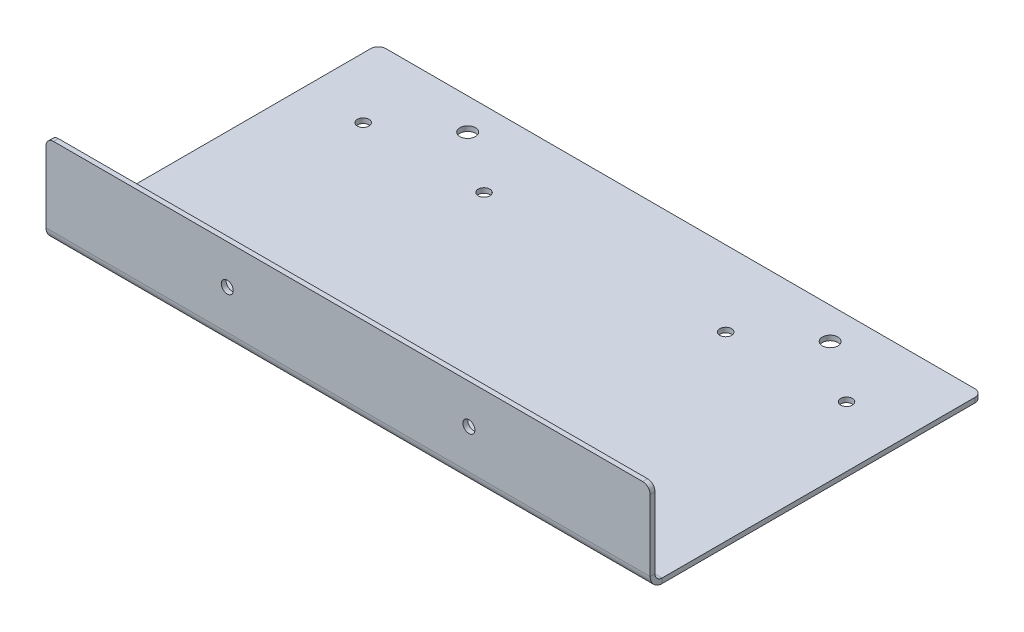
ISO-10303-21;
HEADER;
FILE_DESCRIPTION(('STEP AP214'),'2;1');
FILE_NAME('part.step','',(''),(''),'','','');
FILE_SCHEMA(('AUTOMOTIVE_DESIGN { 1 0 10303 214 1 1 1 1 }'));
ENDSEC;
DATA;
#1=APPLICATION_CONTEXT('core data for automotive mechanical design processes');
#2=APPLICATION_PROTOCOL_DEFINITION('international standard','automotive_design',2000,#1);
#3=PRODUCT_CONTEXT('',#1,'mechanical');
#4=PRODUCT('Part','Part','',(#3));
#5=PRODUCT_RELATED_PRODUCT_CATEGORY('part','',(#4));
#6=PRODUCT_DEFINITION_FORMATION('','',#4);
#7=PRODUCT_DEFINITION_CONTEXT('part definition',#1,'design');
#8=PRODUCT_DEFINITION('design','',#6,#7);
#9=PRODUCT_DEFINITION_SHAPE('','',#8);
#10=(LENGTH_UNIT() NAMED_UNIT(*) SI_UNIT(.MILLI.,.METRE.));
#11=(NAMED_UNIT(*) PLANE_ANGLE_UNIT() SI_UNIT($,.RADIAN.));
#12=(NAMED_UNIT(*) SI_UNIT($,.STERADIAN.) SOLID_ANGLE_UNIT());
#13=UNCERTAINTY_MEASURE_WITH_UNIT(LENGTH_MEASURE(1.E-05),#10,'distance_accuracy_value','');
#14=(GEOMETRIC_REPRESENTATION_CONTEXT(3) GLOBAL_UNCERTAINTY_ASSIGNED_CONTEXT((#13)) GLOBAL_UNIT_ASSIGNED_CONTEXT((#10,
#11,#12)) REPRESENTATION_CONTEXT('',''));
#15=CARTESIAN_POINT('',(0.,0.,0.));
#16=DIRECTION('',(0.,0.,1.));
#17=DIRECTION('',(1.,0.,0.));
#18=AXIS2_PLACEMENT_3D('',#15,#16,#17);
#19=CARTESIAN_POINT('',(254.,-2.052574,0.));
#20=DIRECTION('',(1.,0.,0.));
#21=DIRECTION('',(0.,0.,-1.));
#22=AXIS2_PLACEMENT_3D('',#19,#20,#21);
#23=PLANE('',#22);
#24=DIRECTION('',(0.,0.,-1.));
#25=VECTOR('',#24,1.);
#26=CARTESIAN_POINT('',(254.,-2.052574,0.));
#27=LINE('',#26,#25);
#28=CARTESIAN_POINT('',(254.,-2.05257400000001,-5.052574));
#29=VERTEX_POINT('',#28);
#30=CARTESIAN_POINT('',(254.,-2.052574,-136.525));
#31=VERTEX_POINT('',#30);
#32=EDGE_CURVE('E221',#29,#31,#27,.T.);
#33=ORIENTED_EDGE('',*,*,#32,.T.);
#34=DIRECTION('',(0.,1.,0.));
#35=VECTOR('',#34,1.);
#36=CARTESIAN_POINT('',(254.,-2.052574,-136.525));
#37=LINE('',#36,#35);
#38=CARTESIAN_POINT('',(254.,0.,-136.525));
#39=VERTEX_POINT('',#38);
#40=EDGE_CURVE('E247',#31,#39,#37,.T.);
#41=ORIENTED_EDGE('',*,*,#40,.T.);
#42=DIRECTION('',(0.,0.,-1.));
#43=VECTOR('',#42,1.);
#44=CARTESIAN_POINT('',(254.,0.,0.));
#45=LINE('',#44,#43);
#46=CARTESIAN_POINT('',(254.,0.,-5.052574));
#47=VERTEX_POINT('',#46);
#48=EDGE_CURVE('E229',#47,#39,#45,.T.);
#49=ORIENTED_EDGE('',*,*,#48,.F.);
#50=DIRECTION('',(0.,-1.,0.));
#51=VECTOR('',#50,1.);
#52=CARTESIAN_POINT('',(254.,0.,-5.052574));
#53=LINE('',#52,#51);
#54=EDGE_CURVE('E206',#47,#29,#53,.T.);
#55=ORIENTED_EDGE('',*,*,#54,.T.);
#56=EDGE_LOOP('',(#33,#41,#49,#55));
#57=FACE_BOUND('',#56,.T.);
#58=ADVANCED_FACE('F59',(#57),#23,.T.);
#59=CARTESIAN_POINT('',(0.,-2.052574,0.));
#60=DIRECTION('',(0.,-1.,0.));
#61=DIRECTION('',(0.,0.,-1.));
#62=AXIS2_PLACEMENT_3D('',#59,#60,#61);
#63=PLANE('',#62);
#64=CARTESIAN_POINT('',(203.2,-2.05257400000001,-126.48184));
#65=DIRECTION('',(0.,1.,0.));
#66=DIRECTION('',(0.,0.,1.));
#67=AXIS2_PLACEMENT_3D('',#64,#65,#66);
#68=CIRCLE('',#67,3.26389999999999);
#69=CARTESIAN_POINT('',(203.2,-2.05257400000001,-123.21794));
#70=VERTEX_POINT('',#69);
#71=EDGE_CURVE('E601',#70,#70,#68,.T.);
#72=ORIENTED_EDGE('',*,*,#71,.T.);
#73=EDGE_LOOP('',(#72));
#74=FACE_BOUND('',#73,.T.);
#75=CARTESIAN_POINT('',(50.8,-2.05257400000001,-126.48184));
#76=DIRECTION('',(0.,1.,0.));
#77=DIRECTION('',(0.,0.,1.));
#78=AXIS2_PLACEMENT_3D('',#75,#76,#77);
#79=CIRCLE('',#78,3.2639);
#80=CARTESIAN_POINT('',(50.8,-2.05257400000001,-123.21794));
#81=VERTEX_POINT('',#80);
#82=EDGE_CURVE('E595',#81,#81,#79,.T.);
#83=ORIENTED_EDGE('',*,*,#82,.T.);
#84=EDGE_LOOP('',(#83));
#85=FACE_BOUND('',#84,.T.);
#86=CARTESIAN_POINT('',(25.4,-2.05257400000001,-107.95));
#87=DIRECTION('',(0.,1.,0.));
#88=DIRECTION('',(0.,0.,1.));
#89=AXIS2_PLACEMENT_3D('',#86,#87,#88);
#90=CIRCLE('',#89,2.45745);
#91=CARTESIAN_POINT('',(25.4,-2.05257400000001,-105.49255));
#92=VERTEX_POINT('',#91);
#93=EDGE_CURVE('E589',#92,#92,#90,.T.);
#94=ORIENTED_EDGE('',*,*,#93,.T.);
#95=EDGE_LOOP('',(#94));
#96=FACE_BOUND('',#95,.T.);
#97=CARTESIAN_POINT('',(76.2,-2.05257400000001,-107.95));
#98=DIRECTION('',(0.,1.,0.));
#99=DIRECTION('',(0.,0.,1.));
#100=AXIS2_PLACEMENT_3D('',#97,#98,#99);
#101=CIRCLE('',#100,2.45745);
#102=CARTESIAN_POINT('',(76.2,-2.05257400000001,-105.49255));
#103=VERTEX_POINT('',#102);
#104=EDGE_CURVE('E583',#103,#103,#101,.T.);
#105=ORIENTED_EDGE('',*,*,#104,.T.);
#106=EDGE_LOOP('',(#105));
#107=FACE_BOUND('',#106,.T.);
#108=CARTESIAN_POINT('',(177.8,-2.05257400000001,-107.95));
#109=DIRECTION('',(0.,1.,0.));
#110=DIRECTION('',(0.,0.,1.));
#111=AXIS2_PLACEMENT_3D('',#108,#109,#110);
#112=CIRCLE('',#111,2.45745);
#113=CARTESIAN_POINT('',(177.8,-2.05257400000001,-105.49255));
#114=VERTEX_POINT('',#113);
#115=EDGE_CURVE('E577',#114,#114,#112,.T.);
#116=ORIENTED_EDGE('',*,*,#115,.T.);
#117=EDGE_LOOP('',(#116));
#118=FACE_BOUND('',#117,.T.);
#119=CARTESIAN_POINT('',(228.6,-2.05257400000001,-107.95));
#120=DIRECTION('',(0.,1.,0.));
#121=DIRECTION('',(0.,0.,1.));
#122=AXIS2_PLACEMENT_3D('',#119,#120,#121);
#123=CIRCLE('',#122,2.45745);
#124=CARTESIAN_POINT('',(228.6,-2.05257400000001,-105.49255));
#125=VERTEX_POINT('',#124);
#126=EDGE_CURVE('E571',#125,#125,#123,.T.);
#127=ORIENTED_EDGE('',*,*,#126,.T.);
#128=EDGE_LOOP('',(#127));
#129=FACE_BOUND('',#128,.T.);
#130=DIRECTION('',(-1.,0.,0.));
#131=VECTOR('',#130,1.);
#132=CARTESIAN_POINT('',(0.,-2.052574,-139.7));
#133=LINE('',#132,#131);
#134=CARTESIAN_POINT('',(250.825,-2.052574,-139.7));
#135=VERTEX_POINT('',#134);
#136=CARTESIAN_POINT('',(3.175,-2.052574,-139.7));
#137=VERTEX_POINT('',#136);
#138=EDGE_CURVE('E225',#135,#137,#133,.T.);
#139=ORIENTED_EDGE('',*,*,#138,.F.);
#140=CARTESIAN_POINT('',(250.825,-2.052574,-136.525));
#141=DIRECTION('',(0.,-1.,0.));
#142=DIRECTION('',(0.,0.,-1.));
#143=AXIS2_PLACEMENT_3D('',#140,#141,#142);
#144=CIRCLE('',#143,3.175);
#145=EDGE_CURVE('E260',#135,#31,#144,.T.);
#146=ORIENTED_EDGE('',*,*,#145,.T.);
#147=ORIENTED_EDGE('',*,*,#32,.F.);
#148=DIRECTION('',(1.,0.,0.));
#149=VECTOR('',#148,1.);
#150=CARTESIAN_POINT('',(254.,-2.05257400000001,-5.052574));
#151=LINE('',#150,#149);
#152=CARTESIAN_POINT('',(0.,-2.052574,-5.052574));
#153=VERTEX_POINT('',#152);
#154=EDGE_CURVE('E157',#29,#153,#151,.F.);
#155=ORIENTED_EDGE('',*,*,#154,.T.);
#156=DIRECTION('',(0.,0.,1.));
#157=VECTOR('',#156,1.);
#158=CARTESIAN_POINT('',(0.,-2.052574,0.));
#159=LINE('',#158,#157);
#160=CARTESIAN_POINT('',(0.,-2.052574,-136.525));
#161=VERTEX_POINT('',#160);
#162=EDGE_CURVE('E219',#161,#153,#159,.T.);
#163=ORIENTED_EDGE('',*,*,#162,.F.);
#164=CARTESIAN_POINT('',(3.175,-2.052574,-136.525));
#165=DIRECTION('',(0.,-1.,0.));
#166=DIRECTION('',(0.,0.,-1.));
#167=AXIS2_PLACEMENT_3D('',#164,#165,#166);
#168=CIRCLE('',#167,3.175);
#169=EDGE_CURVE('E80',#161,#137,#168,.T.);
#170=ORIENTED_EDGE('',*,*,#169,.T.);
#171=EDGE_LOOP('',(#139,#146,#147,#155,#163,#170));
#172=FACE_BOUND('',#171,.T.);
#173=ADVANCED_FACE('F263',(#74,#85,#96,#107,#118,#129,#172),#63,.T.);
#174=CARTESIAN_POINT('',(0.,0.,0.));
#175=DIRECTION('',(0.,-1.,0.));
#176=DIRECTION('',(0.,0.,-1.));
#177=AXIS2_PLACEMENT_3D('',#174,#175,#176);
#178=PLANE('',#177);
#179=CARTESIAN_POINT('',(203.2,0.,-126.48184));
#180=DIRECTION('',(0.,1.,0.));
#181=DIRECTION('',(0.,0.,1.));
#182=AXIS2_PLACEMENT_3D('',#179,#180,#181);
#183=CIRCLE('',#182,3.26389999999999);
#184=CARTESIAN_POINT('',(203.2,0.,-123.21794));
#185=VERTEX_POINT('',#184);
#186=EDGE_CURVE('E604',#185,#185,#183,.T.);
#187=ORIENTED_EDGE('',*,*,#186,.F.);
#188=EDGE_LOOP('',(#187));
#189=FACE_BOUND('',#188,.T.);
#190=CARTESIAN_POINT('',(50.8,0.,-126.48184));
#191=DIRECTION('',(0.,1.,0.));
#192=DIRECTION('',(0.,0.,1.));
#193=AXIS2_PLACEMENT_3D('',#190,#191,#192);
#194=CIRCLE('',#193,3.26389999999999);
#195=CARTESIAN_POINT('',(50.8,0.,-123.21794));
#196=VERTEX_POINT('',#195);
#197=EDGE_CURVE('E598',#196,#196,#194,.T.);
#198=ORIENTED_EDGE('',*,*,#197,.F.);
#199=EDGE_LOOP('',(#198));
#200=FACE_BOUND('',#199,.T.);
#201=CARTESIAN_POINT('',(25.4,0.,-107.95));
#202=DIRECTION('',(0.,1.,0.));
#203=DIRECTION('',(0.,0.,1.));
#204=AXIS2_PLACEMENT_3D('',#201,#202,#203);
#205=CIRCLE('',#204,2.45745);
#206=CARTESIAN_POINT('',(25.4,0.,-105.49255));
#207=VERTEX_POINT('',#206);
#208=EDGE_CURVE('E592',#207,#207,#205,.T.);
#209=ORIENTED_EDGE('',*,*,#208,.F.);
#210=EDGE_LOOP('',(#209));
#211=FACE_BOUND('',#210,.T.);
#212=CARTESIAN_POINT('',(76.2,0.,-107.95));
#213=DIRECTION('',(0.,1.,0.));
#214=DIRECTION('',(0.,0.,1.));
#215=AXIS2_PLACEMENT_3D('',#212,#213,#214);
#216=CIRCLE('',#215,2.45745);
#217=CARTESIAN_POINT('',(76.2,0.,-105.49255));
#218=VERTEX_POINT('',#217);
#219=EDGE_CURVE('E586',#218,#218,#216,.T.);
#220=ORIENTED_EDGE('',*,*,#219,.F.);
#221=EDGE_LOOP('',(#220));
#222=FACE_BOUND('',#221,.T.);
#223=CARTESIAN_POINT('',(177.8,0.,-107.95));
#224=DIRECTION('',(0.,1.,0.));
#225=DIRECTION('',(0.,0.,1.));
#226=AXIS2_PLACEMENT_3D('',#223,#224,#225);
#227=CIRCLE('',#226,2.45745);
#228=CARTESIAN_POINT('',(177.8,0.,-105.49255));
#229=VERTEX_POINT('',#228);
#230=EDGE_CURVE('E580',#229,#229,#227,.T.);
#231=ORIENTED_EDGE('',*,*,#230,.F.);
#232=EDGE_LOOP('',(#231));
#233=FACE_BOUND('',#232,.T.);
#234=CARTESIAN_POINT('',(228.6,0.,-107.95));
#235=DIRECTION('',(0.,1.,0.));
#236=DIRECTION('',(0.,0.,1.));
#237=AXIS2_PLACEMENT_3D('',#234,#235,#236);
#238=CIRCLE('',#237,2.45745);
#239=CARTESIAN_POINT('',(228.6,0.,-105.49255));
#240=VERTEX_POINT('',#239);
#241=EDGE_CURVE('E574',#240,#240,#238,.T.);
#242=ORIENTED_EDGE('',*,*,#241,.F.);
#243=EDGE_LOOP('',(#242));
#244=FACE_BOUND('',#243,.T.);
#245=ORIENTED_EDGE('',*,*,#48,.T.);
#246=CARTESIAN_POINT('',(250.825,0.,-136.525));
#247=DIRECTION('',(0.,-1.,0.));
#248=DIRECTION('',(0.,0.,-1.));
#249=AXIS2_PLACEMENT_3D('',#246,#247,#248);
#250=CIRCLE('',#249,3.175);
#251=CARTESIAN_POINT('',(250.825,0.,-139.7));
#252=VERTEX_POINT('',#251);
#253=EDGE_CURVE('E252',#39,#252,#250,.F.);
#254=ORIENTED_EDGE('',*,*,#253,.T.);
#255=DIRECTION('',(-1.,0.,0.));
#256=VECTOR('',#255,1.);
#257=CARTESIAN_POINT('',(0.,0.,-139.7));
#258=LINE('',#257,#256);
#259=CARTESIAN_POINT('',(3.175,0.,-139.7));
#260=VERTEX_POINT('',#259);
#261=EDGE_CURVE('E222',#252,#260,#258,.T.);
#262=ORIENTED_EDGE('',*,*,#261,.T.);
#263=CARTESIAN_POINT('',(3.175,0.,-136.525));
#264=DIRECTION('',(0.,-1.,0.));
#265=DIRECTION('',(0.,0.,-1.));
#266=AXIS2_PLACEMENT_3D('',#263,#264,#265);
#267=CIRCLE('',#266,3.175);
#268=CARTESIAN_POINT('',(0.,0.,-136.525));
#269=VERTEX_POINT('',#268);
#270=EDGE_CURVE('E250',#260,#269,#267,.F.);
#271=ORIENTED_EDGE('',*,*,#270,.T.);
#272=DIRECTION('',(0.,0.,1.));
#273=VECTOR('',#272,1.);
#274=CARTESIAN_POINT('',(0.,0.,0.));
#275=LINE('',#274,#273);
#276=CARTESIAN_POINT('',(0.,0.,-5.052574));
#277=VERTEX_POINT('',#276);
#278=EDGE_CURVE('E217',#269,#277,#275,.T.);
#279=ORIENTED_EDGE('',*,*,#278,.T.);
#280=DIRECTION('',(1.,0.,0.));
#281=VECTOR('',#280,1.);
#282=CARTESIAN_POINT('',(254.,0.,-5.052574));
#283=LINE('',#282,#281);
#284=EDGE_CURVE('E210',#47,#277,#283,.F.);
#285=ORIENTED_EDGE('',*,*,#284,.F.);
#286=EDGE_LOOP('',(#245,#254,#262,#271,#279,#285));
#287=FACE_BOUND('',#286,.T.);
#288=ADVANCED_FACE('F272',(#189,#200,#211,#222,#233,#244,#287),#178,.F.);
#289=CARTESIAN_POINT('',(0.,-2.052574,0.));
#290=DIRECTION('',(-1.,0.,0.));
#291=DIRECTION('',(0.,0.,1.));
#292=AXIS2_PLACEMENT_3D('',#289,#290,#291);
#293=PLANE('',#292);
#294=ORIENTED_EDGE('',*,*,#278,.F.);
#295=DIRECTION('',(0.,1.,0.));
#296=VECTOR('',#295,1.);
#297=CARTESIAN_POINT('',(0.,-2.052574,-136.525));
#298=LINE('',#297,#296);
#299=EDGE_CURVE('E67',#269,#161,#298,.F.);
#300=ORIENTED_EDGE('',*,*,#299,.T.);
#301=ORIENTED_EDGE('',*,*,#162,.T.);
#302=DIRECTION('',(0.,-1.,0.));
#303=VECTOR('',#302,1.);
#304=CARTESIAN_POINT('',(0.,0.,-5.052574));
#305=LINE('',#304,#303);
#306=EDGE_CURVE('E214',#277,#153,#305,.T.);
#307=ORIENTED_EDGE('',*,*,#306,.F.);
#308=EDGE_LOOP('',(#294,#300,#301,#307));
#309=FACE_BOUND('',#308,.T.);
#310=ADVANCED_FACE('F280',(#309),#293,.T.);
#311=CARTESIAN_POINT('',(0.,-2.052574,-139.7));
#312=DIRECTION('',(0.,0.,-1.));
#313=DIRECTION('',(-1.,0.,0.));
#314=AXIS2_PLACEMENT_3D('',#311,#312,#313);
#315=PLANE('',#314);
#316=ORIENTED_EDGE('',*,*,#261,.F.);
#317=DIRECTION('',(0.,1.,0.));
#318=VECTOR('',#317,1.);
#319=CARTESIAN_POINT('',(250.825,-2.052574,-139.7));
#320=LINE('',#319,#318);
#321=EDGE_CURVE('E257',#252,#135,#320,.F.);
#322=ORIENTED_EDGE('',*,*,#321,.T.);
#323=ORIENTED_EDGE('',*,*,#138,.T.);
#324=DIRECTION('',(0.,1.,0.));
#325=VECTOR('',#324,1.);
#326=CARTESIAN_POINT('',(3.175,-2.052574,-139.7));
#327=LINE('',#326,#325);
#328=EDGE_CURVE('E254',#137,#260,#327,.T.);
#329=ORIENTED_EDGE('',*,*,#328,.T.);
#330=EDGE_LOOP('',(#316,#322,#323,#329));
#331=FACE_BOUND('',#330,.T.);
#332=ADVANCED_FACE('F275',(#331),#315,.T.);
#333=CARTESIAN_POINT('',(0.,2.99999999999999,-5.052574));
#334=DIRECTION('',(-1.,0.,0.));
#335=DIRECTION('',(0.,0.,1.));
#336=AXIS2_PLACEMENT_3D('',#333,#334,#335);
#337=PLANE('',#336);
#338=DIRECTION('',(0.,0.,-1.));
#339=VECTOR('',#338,1.);
#340=CARTESIAN_POINT('',(0.,2.99999999999999,0.));
#341=LINE('',#340,#339);
#342=CARTESIAN_POINT('',(0.,2.99999999999999,-2.052574));
#343=VERTEX_POINT('',#342);
#344=CARTESIAN_POINT('',(0.,2.99999999999999,0.));
#345=VERTEX_POINT('',#344);
#346=EDGE_CURVE('E200',#343,#345,#341,.F.);
#347=ORIENTED_EDGE('',*,*,#346,.F.);
#348=CARTESIAN_POINT('',(0.,2.99999999999999,-5.052574));
#349=DIRECTION('',(1.,0.,0.));
#350=DIRECTION('',(0.,0.,-1.));
#351=AXIS2_PLACEMENT_3D('',#348,#349,#350);
#352=CIRCLE('',#351,3.);
#353=EDGE_CURVE('E160',#277,#343,#352,.F.);
#354=ORIENTED_EDGE('',*,*,#353,.F.);
#355=ORIENTED_EDGE('',*,*,#306,.T.);
#356=CARTESIAN_POINT('',(0.,2.99999999999999,-5.052574));
#357=DIRECTION('',(1.,0.,0.));
#358=DIRECTION('',(0.,0.,-1.));
#359=AXIS2_PLACEMENT_3D('',#356,#357,#358);
#360=CIRCLE('',#359,5.052574);
#361=EDGE_CURVE('E205',#153,#345,#360,.F.);
#362=ORIENTED_EDGE('',*,*,#361,.T.);
#363=EDGE_LOOP('',(#347,#354,#355,#362));
#364=FACE_BOUND('',#363,.T.);
#365=ADVANCED_FACE('F284',(#364),#337,.T.);
#366=CARTESIAN_POINT('',(254.,2.99999999999999,-5.052574));
#367=DIRECTION('',(-1.,0.,0.));
#368=DIRECTION('',(0.,0.,1.));
#369=AXIS2_PLACEMENT_3D('',#366,#367,#368);
#370=PLANE('',#369);
#371=CARTESIAN_POINT('',(254.,2.99999999999999,-5.052574));
#372=DIRECTION('',(1.,0.,0.));
#373=DIRECTION('',(0.,0.,-1.));
#374=AXIS2_PLACEMENT_3D('',#371,#372,#373);
#375=CIRCLE('',#374,3.);
#376=CARTESIAN_POINT('',(254.,2.99999999999999,-2.052574));
#377=VERTEX_POINT('',#376);
#378=EDGE_CURVE('E167',#377,#47,#375,.T.);
#379=ORIENTED_EDGE('',*,*,#378,.F.);
#380=DIRECTION('',(0.,0.,-1.));
#381=VECTOR('',#380,1.);
#382=CARTESIAN_POINT('',(254.,2.99999999999999,-2.05257399999999));
#383=LINE('',#382,#381);
#384=CARTESIAN_POINT('',(254.,2.99999999999999,0.));
#385=VERTEX_POINT('',#384);
#386=EDGE_CURVE('E164',#377,#385,#383,.F.);
#387=ORIENTED_EDGE('',*,*,#386,.T.);
#388=CARTESIAN_POINT('',(254.,2.99999999999999,-5.052574));
#389=DIRECTION('',(1.,0.,0.));
#390=DIRECTION('',(0.,0.,-1.));
#391=AXIS2_PLACEMENT_3D('',#388,#389,#390);
#392=CIRCLE('',#391,5.052574);
#393=EDGE_CURVE('E149',#385,#29,#392,.T.);
#394=ORIENTED_EDGE('',*,*,#393,.T.);
#395=ORIENTED_EDGE('',*,*,#54,.F.);
#396=EDGE_LOOP('',(#379,#387,#394,#395));
#397=FACE_BOUND('',#396,.T.);
#398=ADVANCED_FACE('F165',(#397),#370,.F.);
#399=CARTESIAN_POINT('',(254.,2.99999999999999,-5.052574));
#400=DIRECTION('',(1.,0.,0.));
#401=DIRECTION('',(0.,0.,1.));
#402=AXIS2_PLACEMENT_3D('',#399,#400,#401);
#403=CYLINDRICAL_SURFACE('',#402,5.052574);
#404=ORIENTED_EDGE('',*,*,#154,.F.);
#405=ORIENTED_EDGE('',*,*,#393,.F.);
#406=DIRECTION('',(1.,0.,0.));
#407=VECTOR('',#406,1.);
#408=CARTESIAN_POINT('',(0.,2.99999999999999,0.));
#409=LINE('',#408,#407);
#410=EDGE_CURVE('E154',#385,#345,#409,.F.);
#411=ORIENTED_EDGE('',*,*,#410,.T.);
#412=ORIENTED_EDGE('',*,*,#361,.F.);
#413=EDGE_LOOP('',(#404,#405,#411,#412));
#414=FACE_BOUND('',#413,.T.);
#415=ADVANCED_FACE('F151',(#414),#403,.T.);
#416=CARTESIAN_POINT('',(254.,2.99999999999999,-5.052574));
#417=DIRECTION('',(1.,0.,0.));
#418=DIRECTION('',(0.,0.,1.));
#419=AXIS2_PLACEMENT_3D('',#416,#417,#418);
#420=CYLINDRICAL_SURFACE('',#419,3.);
#421=ORIENTED_EDGE('',*,*,#284,.T.);
#422=ORIENTED_EDGE('',*,*,#353,.T.);
#423=DIRECTION('',(1.,0.,0.));
#424=VECTOR('',#423,1.);
#425=CARTESIAN_POINT('',(0.,2.99999999999999,-2.05257399999999));
#426=LINE('',#425,#424);
#427=EDGE_CURVE('E172',#343,#377,#426,.T.);
#428=ORIENTED_EDGE('',*,*,#427,.T.);
#429=ORIENTED_EDGE('',*,*,#378,.T.);
#430=EDGE_LOOP('',(#421,#422,#428,#429));
#431=FACE_BOUND('',#430,.T.);
#432=ADVANCED_FACE('F287',(#431),#420,.F.);
#433=CARTESIAN_POINT('',(0.,0.,0.));
#434=DIRECTION('',(1.,0.,0.));
#435=DIRECTION('',(0.,0.,-1.));
#436=AXIS2_PLACEMENT_3D('',#433,#434,#435);
#437=PLANE('',#436);
#438=DIRECTION('',(0.,-1.,0.));
#439=VECTOR('',#438,1.);
#440=CARTESIAN_POINT('',(0.,0.,0.));
#441=LINE('',#440,#439);
#442=CARTESIAN_POINT('',(0.,32.872426,0.));
#443=VERTEX_POINT('',#442);
#444=EDGE_CURVE('E180',#443,#345,#441,.T.);
#445=ORIENTED_EDGE('',*,*,#444,.F.);
#446=DIRECTION('',(0.,0.,-1.));
#447=VECTOR('',#446,1.);
#448=CARTESIAN_POINT('',(0.,32.872426,0.));
#449=LINE('',#448,#447);
#450=CARTESIAN_POINT('',(0.,32.872426,-2.052574));
#451=VERTEX_POINT('',#450);
#452=EDGE_CURVE('E13',#443,#451,#449,.T.);
#453=ORIENTED_EDGE('',*,*,#452,.T.);
#454=DIRECTION('',(0.,1.,0.));
#455=VECTOR('',#454,1.);
#456=CARTESIAN_POINT('',(0.,0.,-2.052574));
#457=LINE('',#456,#455);
#458=EDGE_CURVE('E181',#451,#343,#457,.F.);
#459=ORIENTED_EDGE('',*,*,#458,.T.);
#460=ORIENTED_EDGE('',*,*,#346,.T.);
#461=EDGE_LOOP('',(#445,#453,#459,#460));
#462=FACE_BOUND('',#461,.T.);
#463=ADVANCED_FACE('F303',(#462),#437,.F.);
#464=CARTESIAN_POINT('',(254.,36.047426,0.));
#465=DIRECTION('',(-1.,0.,0.));
#466=DIRECTION('',(0.,0.,1.));
#467=AXIS2_PLACEMENT_3D('',#464,#465,#466);
#468=PLANE('',#467);
#469=DIRECTION('',(0.,-1.,0.));
#470=VECTOR('',#469,1.);
#471=CARTESIAN_POINT('',(254.,36.047426,-2.052574));
#472=LINE('',#471,#470);
#473=CARTESIAN_POINT('',(254.,32.872426,-2.052574));
#474=VERTEX_POINT('',#473);
#475=EDGE_CURVE('E196',#377,#474,#472,.F.);
#476=ORIENTED_EDGE('',*,*,#475,.T.);
#477=DIRECTION('',(0.,0.,-1.));
#478=VECTOR('',#477,1.);
#479=CARTESIAN_POINT('',(254.,32.872426,0.));
#480=LINE('',#479,#478);
#481=CARTESIAN_POINT('',(254.,32.872426,0.));
#482=VERTEX_POINT('',#481);
#483=EDGE_CURVE('E185',#474,#482,#480,.F.);
#484=ORIENTED_EDGE('',*,*,#483,.T.);
#485=DIRECTION('',(0.,1.,0.));
#486=VECTOR('',#485,1.);
#487=CARTESIAN_POINT('',(254.,0.,0.));
#488=LINE('',#487,#486);
#489=EDGE_CURVE('E177',#385,#482,#488,.T.);
#490=ORIENTED_EDGE('',*,*,#489,.F.);
#491=ORIENTED_EDGE('',*,*,#386,.F.);
#492=EDGE_LOOP('',(#476,#484,#490,#491));
#493=FACE_BOUND('',#492,.T.);
#494=ADVANCED_FACE('F183',(#493),#468,.F.);
#495=CARTESIAN_POINT('',(0.,0.,0.));
#496=DIRECTION('',(0.,0.,-1.));
#497=DIRECTION('',(-1.,0.,0.));
#498=AXIS2_PLACEMENT_3D('',#495,#496,#497);
#499=PLANE('',#498);
#500=CARTESIAN_POINT('',(177.8,19.523713,0.));
#501=DIRECTION('',(0.,0.,-1.));
#502=DIRECTION('',(-1.,0.,0.));
#503=AXIS2_PLACEMENT_3D('',#500,#501,#502);
#504=CIRCLE('',#503,2.52730000000001);
#505=CARTESIAN_POINT('',(175.2727,19.523713,0.));
#506=VERTEX_POINT('',#505);
#507=EDGE_CURVE('E563',#506,#506,#504,.T.);
#508=ORIENTED_EDGE('',*,*,#507,.T.);
#509=EDGE_LOOP('',(#508));
#510=FACE_BOUND('',#509,.T.);
#511=CARTESIAN_POINT('',(76.2,19.523713,0.));
#512=DIRECTION('',(0.,0.,-1.));
#513=DIRECTION('',(-1.,0.,0.));
#514=AXIS2_PLACEMENT_3D('',#511,#512,#513);
#515=CIRCLE('',#514,2.5273);
#516=CARTESIAN_POINT('',(73.6727,19.523713,0.));
#517=VERTEX_POINT('',#516);
#518=EDGE_CURVE('E203',#517,#517,#515,.T.);
#519=ORIENTED_EDGE('',*,*,#518,.T.);
#520=EDGE_LOOP('',(#519));
#521=FACE_BOUND('',#520,.T.);
#522=ORIENTED_EDGE('',*,*,#489,.T.);
#523=CARTESIAN_POINT('',(250.825,32.872426,0.));
#524=DIRECTION('',(0.,0.,-1.));
#525=DIRECTION('',(-1.,0.,0.));
#526=AXIS2_PLACEMENT_3D('',#523,#524,#525);
#527=CIRCLE('',#526,3.175);
#528=CARTESIAN_POINT('',(250.825,36.047426,0.));
#529=VERTEX_POINT('',#528);
#530=EDGE_CURVE('E245',#482,#529,#527,.F.);
#531=ORIENTED_EDGE('',*,*,#530,.T.);
#532=DIRECTION('',(-1.,0.,0.));
#533=VECTOR('',#532,1.);
#534=CARTESIAN_POINT('',(0.,36.047426,0.));
#535=LINE('',#534,#533);
#536=CARTESIAN_POINT('',(3.175,36.047426,0.));
#537=VERTEX_POINT('',#536);
#538=EDGE_CURVE('E186',#529,#537,#535,.T.);
#539=ORIENTED_EDGE('',*,*,#538,.T.);
#540=CARTESIAN_POINT('',(3.175,32.872426,0.));
#541=DIRECTION('',(0.,0.,-1.));
#542=DIRECTION('',(-1.,0.,0.));
#543=AXIS2_PLACEMENT_3D('',#540,#541,#542);
#544=CIRCLE('',#543,3.175);
#545=EDGE_CURVE('E243',#537,#443,#544,.F.);
#546=ORIENTED_EDGE('',*,*,#545,.T.);
#547=ORIENTED_EDGE('',*,*,#444,.T.);
#548=ORIENTED_EDGE('',*,*,#410,.F.);
#549=EDGE_LOOP('',(#522,#531,#539,#546,#547,#548));
#550=FACE_BOUND('',#549,.T.);
#551=ADVANCED_FACE('F176',(#510,#521,#550),#499,.F.);
#552=CARTESIAN_POINT('',(0.,0.,-2.052574));
#553=DIRECTION('',(0.,0.,-1.));
#554=DIRECTION('',(-1.,0.,0.));
#555=AXIS2_PLACEMENT_3D('',#552,#553,#554);
#556=PLANE('',#555);
#557=CARTESIAN_POINT('',(177.8,19.523713,-2.052574));
#558=DIRECTION('',(0.,0.,-1.));
#559=DIRECTION('',(-1.,0.,0.));
#560=AXIS2_PLACEMENT_3D('',#557,#558,#559);
#561=CIRCLE('',#560,2.52730000000001);
#562=CARTESIAN_POINT('',(175.2727,19.523713,-2.052574));
#563=VERTEX_POINT('',#562);
#564=EDGE_CURVE('E566',#563,#563,#561,.T.);
#565=ORIENTED_EDGE('',*,*,#564,.F.);
#566=EDGE_LOOP('',(#565));
#567=FACE_BOUND('',#566,.T.);
#568=CARTESIAN_POINT('',(76.2,19.523713,-2.052574));
#569=DIRECTION('',(0.,0.,-1.));
#570=DIRECTION('',(-1.,0.,0.));
#571=AXIS2_PLACEMENT_3D('',#568,#569,#570);
#572=CIRCLE('',#571,2.5273);
#573=CARTESIAN_POINT('',(73.6727,19.523713,-2.052574));
#574=VERTEX_POINT('',#573);
#575=EDGE_CURVE('E561',#574,#574,#572,.T.);
#576=ORIENTED_EDGE('',*,*,#575,.F.);
#577=EDGE_LOOP('',(#576));
#578=FACE_BOUND('',#577,.T.);
#579=DIRECTION('',(1.,0.,0.));
#580=VECTOR('',#579,1.);
#581=CARTESIAN_POINT('',(0.,36.047426,-2.052574));
#582=LINE('',#581,#580);
#583=CARTESIAN_POINT('',(250.825,36.047426,-2.052574));
#584=VERTEX_POINT('',#583);
#585=CARTESIAN_POINT('',(3.175,36.047426,-2.052574));
#586=VERTEX_POINT('',#585);
#587=EDGE_CURVE('E190',#584,#586,#582,.F.);
#588=ORIENTED_EDGE('',*,*,#587,.F.);
#589=CARTESIAN_POINT('',(250.825,32.872426,-2.052574));
#590=DIRECTION('',(0.,0.,-1.));
#591=DIRECTION('',(-1.,0.,0.));
#592=AXIS2_PLACEMENT_3D('',#589,#590,#591);
#593=CIRCLE('',#592,3.175);
#594=EDGE_CURVE('E240',#584,#474,#593,.T.);
#595=ORIENTED_EDGE('',*,*,#594,.T.);
#596=ORIENTED_EDGE('',*,*,#475,.F.);
#597=ORIENTED_EDGE('',*,*,#427,.F.);
#598=ORIENTED_EDGE('',*,*,#458,.F.);
#599=CARTESIAN_POINT('',(3.175,32.872426,-2.052574));
#600=DIRECTION('',(0.,0.,-1.));
#601=DIRECTION('',(-1.,0.,0.));
#602=AXIS2_PLACEMENT_3D('',#599,#600,#601);
#603=CIRCLE('',#602,3.175);
#604=EDGE_CURVE('E238',#451,#586,#603,.T.);
#605=ORIENTED_EDGE('',*,*,#604,.T.);
#606=EDGE_LOOP('',(#588,#595,#596,#597,#598,#605));
#607=FACE_BOUND('',#606,.T.);
#608=ADVANCED_FACE('F291',(#567,#578,#607),#556,.T.);
#609=CARTESIAN_POINT('',(0.,36.047426,0.));
#610=DIRECTION('',(0.,-1.,0.));
#611=DIRECTION('',(0.,0.,-1.));
#612=AXIS2_PLACEMENT_3D('',#609,#610,#611);
#613=PLANE('',#612);
#614=ORIENTED_EDGE('',*,*,#538,.F.);
#615=DIRECTION('',(0.,0.,-1.));
#616=VECTOR('',#615,1.);
#617=CARTESIAN_POINT('',(250.825,36.047426,0.));
#618=LINE('',#617,#616);
#619=EDGE_CURVE('E235',#529,#584,#618,.T.);
#620=ORIENTED_EDGE('',*,*,#619,.T.);
#621=ORIENTED_EDGE('',*,*,#587,.T.);
#622=DIRECTION('',(0.,0.,-1.));
#623=VECTOR('',#622,1.);
#624=CARTESIAN_POINT('',(3.175,36.047426,0.));
#625=LINE('',#624,#623);
#626=EDGE_CURVE('E227',#586,#537,#625,.F.);
#627=ORIENTED_EDGE('',*,*,#626,.T.);
#628=EDGE_LOOP('',(#614,#620,#621,#627));
#629=FACE_BOUND('',#628,.T.);
#630=ADVANCED_FACE('F298',(#629),#613,.F.);
#631=CARTESIAN_POINT('',(76.2,19.523713,-2.052574));
#632=DIRECTION('',(0.,0.,-1.));
#633=DIRECTION('',(-1.,0.,0.));
#634=AXIS2_PLACEMENT_3D('',#631,#632,#633);
#635=CYLINDRICAL_SURFACE('',#634,2.5273);
#636=ORIENTED_EDGE('',*,*,#518,.F.);
#637=EDGE_LOOP('',(#636));
#638=FACE_BOUND('',#637,.T.);
#639=ORIENTED_EDGE('',*,*,#575,.T.);
#640=EDGE_LOOP('',(#639));
#641=FACE_BOUND('',#640,.T.);
#642=ADVANCED_FACE('F362',(#638,#641),#635,.F.);
#643=CARTESIAN_POINT('',(177.8,19.523713,-2.052574));
#644=DIRECTION('',(0.,0.,-1.));
#645=DIRECTION('',(-1.,0.,0.));
#646=AXIS2_PLACEMENT_3D('',#643,#644,#645);
#647=CYLINDRICAL_SURFACE('',#646,2.52730000000001);
#648=ORIENTED_EDGE('',*,*,#507,.F.);
#649=EDGE_LOOP('',(#648));
#650=FACE_BOUND('',#649,.T.);
#651=ORIENTED_EDGE('',*,*,#564,.T.);
#652=EDGE_LOOP('',(#651));
#653=FACE_BOUND('',#652,.T.);
#654=ADVANCED_FACE('F490',(#650,#653),#647,.F.);
#655=CARTESIAN_POINT('',(228.6,0.,-107.95));
#656=DIRECTION('',(0.,1.,0.));
#657=DIRECTION('',(0.,0.,1.));
#658=AXIS2_PLACEMENT_3D('',#655,#656,#657);
#659=CYLINDRICAL_SURFACE('',#658,2.45745);
#660=ORIENTED_EDGE('',*,*,#126,.F.);
#661=EDGE_LOOP('',(#660));
#662=FACE_BOUND('',#661,.T.);
#663=ORIENTED_EDGE('',*,*,#241,.T.);
#664=EDGE_LOOP('',(#663));
#665=FACE_BOUND('',#664,.T.);
#666=ADVANCED_FACE('F480',(#662,#665),#659,.F.);
#667=CARTESIAN_POINT('',(177.8,0.,-107.95));
#668=DIRECTION('',(0.,1.,0.));
#669=DIRECTION('',(0.,0.,1.));
#670=AXIS2_PLACEMENT_3D('',#667,#668,#669);
#671=CYLINDRICAL_SURFACE('',#670,2.45745);
#672=ORIENTED_EDGE('',*,*,#115,.F.);
#673=EDGE_LOOP('',(#672));
#674=FACE_BOUND('',#673,.T.);
#675=ORIENTED_EDGE('',*,*,#230,.T.);
#676=EDGE_LOOP('',(#675));
#677=FACE_BOUND('',#676,.T.);
#678=ADVANCED_FACE('F470',(#674,#677),#671,.F.);
#679=CARTESIAN_POINT('',(76.2,0.,-107.95));
#680=DIRECTION('',(0.,1.,0.));
#681=DIRECTION('',(0.,0.,1.));
#682=AXIS2_PLACEMENT_3D('',#679,#680,#681);
#683=CYLINDRICAL_SURFACE('',#682,2.45745);
#684=ORIENTED_EDGE('',*,*,#104,.F.);
#685=EDGE_LOOP('',(#684));
#686=FACE_BOUND('',#685,.T.);
#687=ORIENTED_EDGE('',*,*,#219,.T.);
#688=EDGE_LOOP('',(#687));
#689=FACE_BOUND('',#688,.T.);
#690=ADVANCED_FACE('F460',(#686,#689),#683,.F.);
#691=CARTESIAN_POINT('',(25.4,0.,-107.95));
#692=DIRECTION('',(0.,1.,0.));
#693=DIRECTION('',(0.,0.,1.));
#694=AXIS2_PLACEMENT_3D('',#691,#692,#693);
#695=CYLINDRICAL_SURFACE('',#694,2.45745);
#696=ORIENTED_EDGE('',*,*,#93,.F.);
#697=EDGE_LOOP('',(#696));
#698=FACE_BOUND('',#697,.T.);
#699=ORIENTED_EDGE('',*,*,#208,.T.);
#700=EDGE_LOOP('',(#699));
#701=FACE_BOUND('',#700,.T.);
#702=ADVANCED_FACE('F450',(#698,#701),#695,.F.);
#703=CARTESIAN_POINT('',(50.8,0.,-126.48184));
#704=DIRECTION('',(0.,1.,0.));
#705=DIRECTION('',(0.,0.,1.));
#706=AXIS2_PLACEMENT_3D('',#703,#704,#705);
#707=CYLINDRICAL_SURFACE('',#706,3.26389999999999);
#708=ORIENTED_EDGE('',*,*,#82,.F.);
#709=EDGE_LOOP('',(#708));
#710=FACE_BOUND('',#709,.T.);
#711=ORIENTED_EDGE('',*,*,#197,.T.);
#712=EDGE_LOOP('',(#711));
#713=FACE_BOUND('',#712,.T.);
#714=ADVANCED_FACE('F440',(#710,#713),#707,.F.);
#715=CARTESIAN_POINT('',(203.2,0.,-126.48184));
#716=DIRECTION('',(0.,1.,0.));
#717=DIRECTION('',(0.,0.,1.));
#718=AXIS2_PLACEMENT_3D('',#715,#716,#717);
#719=CYLINDRICAL_SURFACE('',#718,3.26389999999999);
#720=ORIENTED_EDGE('',*,*,#71,.F.);
#721=EDGE_LOOP('',(#720));
#722=FACE_BOUND('',#721,.T.);
#723=ORIENTED_EDGE('',*,*,#186,.T.);
#724=EDGE_LOOP('',(#723));
#725=FACE_BOUND('',#724,.T.);
#726=ADVANCED_FACE('F327',(#722,#725),#719,.F.);
#727=CARTESIAN_POINT('',(250.825,32.872426,0.));
#728=DIRECTION('',(0.,0.,-1.));
#729=DIRECTION('',(-1.,0.,0.));
#730=AXIS2_PLACEMENT_3D('',#727,#728,#729);
#731=CYLINDRICAL_SURFACE('',#730,3.175);
#732=ORIENTED_EDGE('',*,*,#530,.F.);
#733=ORIENTED_EDGE('',*,*,#483,.F.);
#734=ORIENTED_EDGE('',*,*,#594,.F.);
#735=ORIENTED_EDGE('',*,*,#619,.F.);
#736=EDGE_LOOP('',(#732,#733,#734,#735));
#737=FACE_BOUND('',#736,.T.);
#738=ADVANCED_FACE('F293',(#737),#731,.T.);
#739=CARTESIAN_POINT('',(250.825,-2.052574,-136.525));
#740=DIRECTION('',(0.,1.,0.));
#741=DIRECTION('',(0.,0.,1.));
#742=AXIS2_PLACEMENT_3D('',#739,#740,#741);
#743=CYLINDRICAL_SURFACE('',#742,3.175);
#744=ORIENTED_EDGE('',*,*,#145,.F.);
#745=ORIENTED_EDGE('',*,*,#321,.F.);
#746=ORIENTED_EDGE('',*,*,#253,.F.);
#747=ORIENTED_EDGE('',*,*,#40,.F.);
#748=EDGE_LOOP('',(#744,#745,#746,#747));
#749=FACE_BOUND('',#748,.T.);
#750=ADVANCED_FACE('F269',(#749),#743,.T.);
#751=CARTESIAN_POINT('',(3.175,-2.052574,-136.525));
#752=DIRECTION('',(0.,1.,0.));
#753=DIRECTION('',(0.,0.,1.));
#754=AXIS2_PLACEMENT_3D('',#751,#752,#753);
#755=CYLINDRICAL_SURFACE('',#754,3.175);
#756=ORIENTED_EDGE('',*,*,#169,.F.);
#757=ORIENTED_EDGE('',*,*,#299,.F.);
#758=ORIENTED_EDGE('',*,*,#270,.F.);
#759=ORIENTED_EDGE('',*,*,#328,.F.);
#760=EDGE_LOOP('',(#756,#757,#758,#759));
#761=FACE_BOUND('',#760,.T.);
#762=ADVANCED_FACE('F278',(#761),#755,.T.);
#763=CARTESIAN_POINT('',(3.175,32.872426,0.));
#764=DIRECTION('',(0.,0.,-1.));
#765=DIRECTION('',(-1.,0.,0.));
#766=AXIS2_PLACEMENT_3D('',#763,#764,#765);
#767=CYLINDRICAL_SURFACE('',#766,3.175);
#768=ORIENTED_EDGE('',*,*,#545,.F.);
#769=ORIENTED_EDGE('',*,*,#626,.F.);
#770=ORIENTED_EDGE('',*,*,#604,.F.);
#771=ORIENTED_EDGE('',*,*,#452,.F.);
#772=EDGE_LOOP('',(#768,#769,#770,#771));
#773=FACE_BOUND('',#772,.T.);
#774=ADVANCED_FACE('F61',(#773),#767,.T.);
#775=CLOSED_SHELL('',(#58,#173,#288,#310,#332,#365,#398,#415,#432,#463,#494,#551,#608,#630,#642,
#654,#666,#678,#690,#702,#714,#726,#738,#750,#762,#774));
#776=MANIFOLD_SOLID_BREP('B2',#775);
#777=ADVANCED_BREP_SHAPE_REPRESENTATION('',(#18,#776),#14);
#778=SHAPE_DEFINITION_REPRESENTATION(#9,#777);
ENDSEC;
END-ISO-10303-21;
